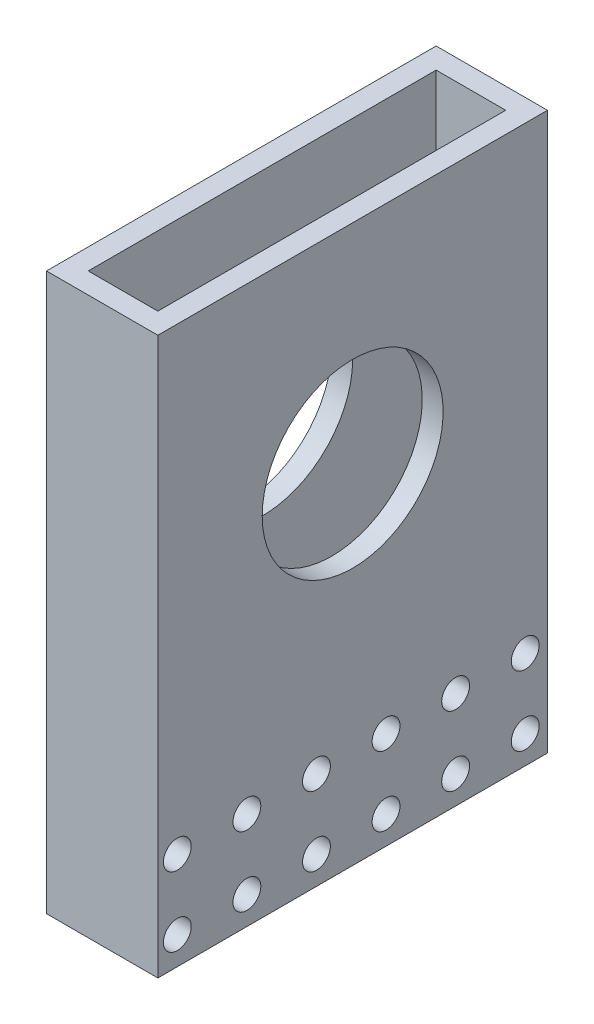
ISO-10303-21;
HEADER;
FILE_DESCRIPTION(('STEP AP214'),'2;1');
FILE_NAME('part.step','',(''),(''),'','','');
FILE_SCHEMA(('AUTOMOTIVE_DESIGN { 1 0 10303 214 1 1 1 1 }'));
ENDSEC;
DATA;
#1=APPLICATION_CONTEXT('core data for automotive mechanical design processes');
#2=APPLICATION_PROTOCOL_DEFINITION('international standard','automotive_design',2000,#1);
#3=PRODUCT_CONTEXT('',#1,'mechanical');
#4=PRODUCT('Part','Part','',(#3));
#5=PRODUCT_RELATED_PRODUCT_CATEGORY('part','',(#4));
#6=PRODUCT_DEFINITION_FORMATION('','',#4);
#7=PRODUCT_DEFINITION_CONTEXT('part definition',#1,'design');
#8=PRODUCT_DEFINITION('design','',#6,#7);
#9=PRODUCT_DEFINITION_SHAPE('','',#8);
#10=(LENGTH_UNIT() NAMED_UNIT(*) SI_UNIT(.MILLI.,.METRE.));
#11=(NAMED_UNIT(*) PLANE_ANGLE_UNIT() SI_UNIT($,.RADIAN.));
#12=(NAMED_UNIT(*) SI_UNIT($,.STERADIAN.) SOLID_ANGLE_UNIT());
#13=UNCERTAINTY_MEASURE_WITH_UNIT(LENGTH_MEASURE(1.E-05),#10,'distance_accuracy_value','');
#14=(GEOMETRIC_REPRESENTATION_CONTEXT(3) GLOBAL_UNCERTAINTY_ASSIGNED_CONTEXT((#13)) GLOBAL_UNIT_ASSIGNED_CONTEXT((#10,
#11,#12)) REPRESENTATION_CONTEXT('',''));
#15=CARTESIAN_POINT('',(0.,0.,0.));
#16=DIRECTION('',(0.,0.,1.));
#17=DIRECTION('',(1.,0.,0.));
#18=AXIS2_PLACEMENT_3D('',#15,#16,#17);
#19=CARTESIAN_POINT('',(-5.,80.,-25.));
#20=DIRECTION('',(0.,0.,1.));
#21=DIRECTION('',(1.,0.,0.));
#22=AXIS2_PLACEMENT_3D('',#19,#20,#21);
#23=PLANE('',#22);
#24=DIRECTION('',(-1.,0.,0.));
#25=VECTOR('',#24,1.);
#26=CARTESIAN_POINT('',(8.,16.005241127961,-25.));
#27=LINE('',#26,#25);
#28=CARTESIAN_POINT('',(5.,16.005241127961,-25.));
#29=VERTEX_POINT('',#28);
#30=CARTESIAN_POINT('',(-5.,16.005241127961,-25.));
#31=VERTEX_POINT('',#30);
#32=EDGE_CURVE('E94',#29,#31,#27,.T.);
#33=ORIENTED_EDGE('',*,*,#32,.F.);
#34=DIRECTION('',(0.,-1.,0.));
#35=VECTOR('',#34,1.);
#36=CARTESIAN_POINT('',(5.,80.,-25.));
#37=LINE('',#36,#35);
#38=CARTESIAN_POINT('',(5.,80.,-25.));
#39=VERTEX_POINT('',#38);
#40=EDGE_CURVE('E238',#39,#29,#37,.T.);
#41=ORIENTED_EDGE('',*,*,#40,.F.);
#42=DIRECTION('',(-1.,0.,0.));
#43=VECTOR('',#42,1.);
#44=CARTESIAN_POINT('',(-5.,80.,-25.));
#45=LINE('',#44,#43);
#46=CARTESIAN_POINT('',(-5.,80.,-25.));
#47=VERTEX_POINT('',#46);
#48=EDGE_CURVE('E354',#39,#47,#45,.T.);
#49=ORIENTED_EDGE('',*,*,#48,.T.);
#50=DIRECTION('',(0.,-1.,0.));
#51=VECTOR('',#50,1.);
#52=CARTESIAN_POINT('',(-5.,80.,-25.));
#53=LINE('',#52,#51);
#54=EDGE_CURVE('E232',#47,#31,#53,.T.);
#55=ORIENTED_EDGE('',*,*,#54,.T.);
#56=EDGE_LOOP('',(#33,#41,#49,#55));
#57=FACE_BOUND('',#56,.T.);
#58=ADVANCED_FACE('F69',(#57),#23,.T.);
#59=DIRECTION('',(-1.,0.,0.));
#60=VECTOR('',#59,1.);
#61=CARTESIAN_POINT('',(8.,12.0258257956885,-25.));
#62=LINE('',#61,#60);
#63=CARTESIAN_POINT('',(-5.,12.0258257956885,-25.));
#64=VERTEX_POINT('',#63);
#65=CARTESIAN_POINT('',(5.,12.0258257956885,-25.));
#66=VERTEX_POINT('',#65);
#67=EDGE_CURVE('E431',#64,#66,#62,.F.);
#68=ORIENTED_EDGE('',*,*,#67,.F.);
#69=CARTESIAN_POINT('',(-5.,6.00524112796099,-25.));
#70=VERTEX_POINT('',#69);
#71=EDGE_CURVE('E237',#64,#70,#53,.T.);
#72=ORIENTED_EDGE('',*,*,#71,.T.);
#73=DIRECTION('',(-1.,0.,0.));
#74=VECTOR('',#73,1.);
#75=CARTESIAN_POINT('',(8.,6.00524112796099,-25.));
#76=LINE('',#75,#74);
#77=CARTESIAN_POINT('',(5.,6.00524112796099,-25.));
#78=VERTEX_POINT('',#77);
#79=EDGE_CURVE('E87',#78,#70,#76,.T.);
#80=ORIENTED_EDGE('',*,*,#79,.F.);
#81=EDGE_CURVE('E243',#66,#78,#37,.T.);
#82=ORIENTED_EDGE('',*,*,#81,.F.);
#83=EDGE_LOOP('',(#68,#72,#80,#82));
#84=FACE_BOUND('',#83,.T.);
#85=ADVANCED_FACE('F453',(#84),#23,.T.);
#86=CARTESIAN_POINT('',(-5.,80.,25.));
#87=DIRECTION('',(0.,0.,-1.));
#88=DIRECTION('',(-1.,0.,0.));
#89=AXIS2_PLACEMENT_3D('',#86,#87,#88);
#90=PLANE('',#89);
#91=DIRECTION('',(-1.,0.,0.));
#92=VECTOR('',#91,1.);
#93=CARTESIAN_POINT('',(8.00000000000001,12.0258257956885,25.));
#94=LINE('',#93,#92);
#95=CARTESIAN_POINT('',(5.,12.0258257956885,25.));
#96=VERTEX_POINT('',#95);
#97=CARTESIAN_POINT('',(-5.,12.0258257956885,25.));
#98=VERTEX_POINT('',#97);
#99=EDGE_CURVE('E213',#96,#98,#94,.T.);
#100=ORIENTED_EDGE('',*,*,#99,.F.);
#101=DIRECTION('',(0.,-1.,0.));
#102=VECTOR('',#101,1.);
#103=CARTESIAN_POINT('',(5.,80.,25.));
#104=LINE('',#103,#102);
#105=CARTESIAN_POINT('',(5.,6.00524112796099,25.));
#106=VERTEX_POINT('',#105);
#107=EDGE_CURVE('E205',#96,#106,#104,.T.);
#108=ORIENTED_EDGE('',*,*,#107,.T.);
#109=DIRECTION('',(-1.,0.,0.));
#110=VECTOR('',#109,1.);
#111=CARTESIAN_POINT('',(8.00000000000001,6.00524112796099,25.));
#112=LINE('',#111,#110);
#113=CARTESIAN_POINT('',(-5.,6.005241127961,25.));
#114=VERTEX_POINT('',#113);
#115=EDGE_CURVE('E183',#114,#106,#112,.F.);
#116=ORIENTED_EDGE('',*,*,#115,.F.);
#117=DIRECTION('',(0.,-1.,0.));
#118=VECTOR('',#117,1.);
#119=CARTESIAN_POINT('',(-5.,80.,25.));
#120=LINE('',#119,#118);
#121=EDGE_CURVE('E231',#98,#114,#120,.T.);
#122=ORIENTED_EDGE('',*,*,#121,.F.);
#123=EDGE_LOOP('',(#100,#108,#116,#122));
#124=FACE_BOUND('',#123,.T.);
#125=ADVANCED_FACE('F212',(#124),#90,.T.);
#126=DIRECTION('',(-1.,0.,0.));
#127=VECTOR('',#126,1.);
#128=CARTESIAN_POINT('',(8.00000000000001,2.02582579568853,25.));
#129=LINE('',#128,#127);
#130=CARTESIAN_POINT('',(5.,2.02582579568853,25.));
#131=VERTEX_POINT('',#130);
#132=CARTESIAN_POINT('',(-5.,2.02582579568853,25.));
#133=VERTEX_POINT('',#132);
#134=EDGE_CURVE('E196',#131,#133,#129,.T.);
#135=ORIENTED_EDGE('',*,*,#134,.F.);
#136=CARTESIAN_POINT('',(5.,0.,25.));
#137=VERTEX_POINT('',#136);
#138=EDGE_CURVE('E207',#131,#137,#104,.T.);
#139=ORIENTED_EDGE('',*,*,#138,.T.);
#140=DIRECTION('',(1.,0.,0.));
#141=VECTOR('',#140,1.);
#142=CARTESIAN_POINT('',(-5.,0.,25.));
#143=LINE('',#142,#141);
#144=CARTESIAN_POINT('',(-5.,0.,25.));
#145=VERTEX_POINT('',#144);
#146=EDGE_CURVE('E224',#145,#137,#143,.T.);
#147=ORIENTED_EDGE('',*,*,#146,.F.);
#148=EDGE_CURVE('E220',#133,#145,#120,.T.);
#149=ORIENTED_EDGE('',*,*,#148,.F.);
#150=EDGE_LOOP('',(#135,#139,#147,#149));
#151=FACE_BOUND('',#150,.T.);
#152=ADVANCED_FACE('F380',(#151),#90,.T.);
#153=CARTESIAN_POINT('',(0.,80.,0.));
#154=DIRECTION('',(0.,1.,0.));
#155=DIRECTION('',(0.,0.,1.));
#156=AXIS2_PLACEMENT_3D('',#153,#154,#155);
#157=PLANE('',#156);
#158=DIRECTION('',(0.,0.,-1.));
#159=VECTOR('',#158,1.);
#160=CARTESIAN_POINT('',(8.,80.,-25.));
#161=LINE('',#160,#159);
#162=CARTESIAN_POINT('',(8.,80.,28.));
#163=VERTEX_POINT('',#162);
#164=CARTESIAN_POINT('',(8.,80.,-28.));
#165=VERTEX_POINT('',#164);
#166=EDGE_CURVE('E244',#163,#165,#161,.T.);
#167=ORIENTED_EDGE('',*,*,#166,.T.);
#168=DIRECTION('',(-1.,0.,0.));
#169=VECTOR('',#168,1.);
#170=CARTESIAN_POINT('',(-5.,80.,-28.));
#171=LINE('',#170,#169);
#172=CARTESIAN_POINT('',(-8.,80.,-28.));
#173=VERTEX_POINT('',#172);
#174=EDGE_CURVE('E248',#165,#173,#171,.T.);
#175=ORIENTED_EDGE('',*,*,#174,.T.);
#176=DIRECTION('',(0.,0.,1.));
#177=VECTOR('',#176,1.);
#178=CARTESIAN_POINT('',(-8.,80.,-25.));
#179=LINE('',#178,#177);
#180=CARTESIAN_POINT('',(-8.,80.,28.));
#181=VERTEX_POINT('',#180);
#182=EDGE_CURVE('E252',#173,#181,#179,.T.);
#183=ORIENTED_EDGE('',*,*,#182,.T.);
#184=DIRECTION('',(1.,0.,0.));
#185=VECTOR('',#184,1.);
#186=CARTESIAN_POINT('',(-5.,80.,28.));
#187=LINE('',#186,#185);
#188=EDGE_CURVE('E255',#181,#163,#187,.T.);
#189=ORIENTED_EDGE('',*,*,#188,.T.);
#190=EDGE_LOOP('',(#167,#175,#183,#189));
#191=FACE_BOUND('',#190,.T.);
#192=ORIENTED_EDGE('',*,*,#48,.F.);
#193=DIRECTION('',(0.,0.,-1.));
#194=VECTOR('',#193,1.);
#195=CARTESIAN_POINT('',(5.,80.,-25.));
#196=LINE('',#195,#194);
#197=CARTESIAN_POINT('',(5.,80.,25.));
#198=VERTEX_POINT('',#197);
#199=EDGE_CURVE('E351',#198,#39,#196,.T.);
#200=ORIENTED_EDGE('',*,*,#199,.F.);
#201=DIRECTION('',(1.,0.,0.));
#202=VECTOR('',#201,1.);
#203=CARTESIAN_POINT('',(-5.,80.,25.));
#204=LINE('',#203,#202);
#205=CARTESIAN_POINT('',(-5.,80.,25.));
#206=VERTEX_POINT('',#205);
#207=EDGE_CURVE('E221',#206,#198,#204,.T.);
#208=ORIENTED_EDGE('',*,*,#207,.F.);
#209=DIRECTION('',(0.,0.,1.));
#210=VECTOR('',#209,1.);
#211=CARTESIAN_POINT('',(-5.,80.,-25.));
#212=LINE('',#211,#210);
#213=EDGE_CURVE('E357',#47,#206,#212,.T.);
#214=ORIENTED_EDGE('',*,*,#213,.F.);
#215=EDGE_LOOP('',(#192,#200,#208,#214));
#216=FACE_BOUND('',#215,.T.);
#217=ADVANCED_FACE('F448',(#191,#216),#157,.T.);
#218=CARTESIAN_POINT('',(0.,0.,0.));
#219=DIRECTION('',(0.,1.,0.));
#220=DIRECTION('',(0.,0.,1.));
#221=AXIS2_PLACEMENT_3D('',#218,#219,#220);
#222=PLANE('',#221);
#223=DIRECTION('',(0.,0.,-1.));
#224=VECTOR('',#223,1.);
#225=CARTESIAN_POINT('',(8.,0.,-25.));
#226=LINE('',#225,#224);
#227=CARTESIAN_POINT('',(8.,0.,28.));
#228=VERTEX_POINT('',#227);
#229=CARTESIAN_POINT('',(8.,0.,-28.));
#230=VERTEX_POINT('',#229);
#231=EDGE_CURVE('E242',#228,#230,#226,.T.);
#232=ORIENTED_EDGE('',*,*,#231,.F.);
#233=DIRECTION('',(1.,0.,0.));
#234=VECTOR('',#233,1.);
#235=CARTESIAN_POINT('',(-5.,0.,28.));
#236=LINE('',#235,#234);
#237=CARTESIAN_POINT('',(-8.,0.,28.));
#238=VERTEX_POINT('',#237);
#239=EDGE_CURVE('E249',#238,#228,#236,.T.);
#240=ORIENTED_EDGE('',*,*,#239,.F.);
#241=DIRECTION('',(0.,0.,1.));
#242=VECTOR('',#241,1.);
#243=CARTESIAN_POINT('',(-8.,0.,-25.));
#244=LINE('',#243,#242);
#245=CARTESIAN_POINT('',(-8.,0.,-28.));
#246=VERTEX_POINT('',#245);
#247=EDGE_CURVE('E265',#246,#238,#244,.T.);
#248=ORIENTED_EDGE('',*,*,#247,.F.);
#249=DIRECTION('',(-1.,0.,0.));
#250=VECTOR('',#249,1.);
#251=CARTESIAN_POINT('',(-5.,0.,-28.));
#252=LINE('',#251,#250);
#253=EDGE_CURVE('E262',#230,#246,#252,.T.);
#254=ORIENTED_EDGE('',*,*,#253,.F.);
#255=EDGE_LOOP('',(#232,#240,#248,#254));
#256=FACE_BOUND('',#255,.T.);
#257=DIRECTION('',(0.,0.,-1.));
#258=VECTOR('',#257,1.);
#259=CARTESIAN_POINT('',(5.,0.,-25.));
#260=LINE('',#259,#258);
#261=CARTESIAN_POINT('',(5.,0.,-25.));
#262=VERTEX_POINT('',#261);
#263=EDGE_CURVE('E350',#137,#262,#260,.T.);
#264=ORIENTED_EDGE('',*,*,#263,.T.);
#265=DIRECTION('',(-1.,0.,0.));
#266=VECTOR('',#265,1.);
#267=CARTESIAN_POINT('',(-5.,0.,-25.));
#268=LINE('',#267,#266);
#269=CARTESIAN_POINT('',(-5.,0.,-25.));
#270=VERTEX_POINT('',#269);
#271=EDGE_CURVE('E366',#262,#270,#268,.T.);
#272=ORIENTED_EDGE('',*,*,#271,.T.);
#273=DIRECTION('',(0.,0.,1.));
#274=VECTOR('',#273,1.);
#275=CARTESIAN_POINT('',(-5.,0.,-25.));
#276=LINE('',#275,#274);
#277=EDGE_CURVE('E369',#270,#145,#276,.T.);
#278=ORIENTED_EDGE('',*,*,#277,.T.);
#279=ORIENTED_EDGE('',*,*,#146,.T.);
#280=EDGE_LOOP('',(#264,#272,#278,#279));
#281=FACE_BOUND('',#280,.T.);
#282=ADVANCED_FACE('F377',(#256,#281),#222,.F.);
#283=CARTESIAN_POINT('',(8.,80.,-25.));
#284=DIRECTION('',(-1.,0.,0.));
#285=DIRECTION('',(0.,0.,1.));
#286=AXIS2_PLACEMENT_3D('',#283,#284,#285);
#287=PLANE('',#286);
#288=CARTESIAN_POINT('',(8.00000000000001,50.,0.));
#289=DIRECTION('',(-1.,0.,0.));
#290=DIRECTION('',(0.,0.,1.));
#291=AXIS2_PLACEMENT_3D('',#288,#289,#290);
#292=CIRCLE('',#291,13.);
#293=CARTESIAN_POINT('',(8.00000000000001,50.,13.));
#294=VERTEX_POINT('',#293);
#295=EDGE_CURVE('E515',#294,#294,#292,.T.);
#296=ORIENTED_EDGE('',*,*,#295,.T.);
#297=EDGE_LOOP('',(#296));
#298=FACE_BOUND('',#297,.T.);
#299=CARTESIAN_POINT('',(8.00000000000001,14.0155334618248,5.2026410701677));
#300=DIRECTION('',(-1.,0.,0.));
#301=DIRECTION('',(0.,0.,1.));
#302=AXIS2_PLACEMENT_3D('',#299,#300,#301);
#303=CIRCLE('',#302,2.);
#304=CARTESIAN_POINT('',(8.00000000000001,14.0155334618248,7.20264107016771));
#305=VERTEX_POINT('',#304);
#306=EDGE_CURVE('E519',#305,#305,#303,.T.);
#307=ORIENTED_EDGE('',*,*,#306,.T.);
#308=EDGE_LOOP('',(#307));
#309=FACE_BOUND('',#308,.T.);
#310=CARTESIAN_POINT('',(8.00000000000001,14.0155334618248,15.2026410701677));
#311=DIRECTION('',(-1.,0.,0.));
#312=DIRECTION('',(0.,0.,1.));
#313=AXIS2_PLACEMENT_3D('',#310,#311,#312);
#314=CIRCLE('',#313,2.);
#315=CARTESIAN_POINT('',(8.00000000000001,14.0155334618248,17.2026410701677));
#316=VERTEX_POINT('',#315);
#317=EDGE_CURVE('E523',#316,#316,#314,.T.);
#318=ORIENTED_EDGE('',*,*,#317,.T.);
#319=EDGE_LOOP('',(#318));
#320=FACE_BOUND('',#319,.T.);
#321=CARTESIAN_POINT('',(8.00000000000001,14.0155334618248,25.2026410701677));
#322=DIRECTION('',(-1.,0.,0.));
#323=DIRECTION('',(0.,0.,1.));
#324=AXIS2_PLACEMENT_3D('',#321,#322,#323);
#325=CIRCLE('',#324,2.);
#326=CARTESIAN_POINT('',(8.00000000000001,14.0155334618248,27.2026410701677));
#327=VERTEX_POINT('',#326);
#328=EDGE_CURVE('E527',#327,#327,#325,.T.);
#329=ORIENTED_EDGE('',*,*,#328,.T.);
#330=EDGE_LOOP('',(#329));
#331=FACE_BOUND('',#330,.T.);
#332=CARTESIAN_POINT('',(8.,14.0155334618248,-24.7973589298323));
#333=DIRECTION('',(-1.,0.,0.));
#334=DIRECTION('',(0.,0.,1.));
#335=AXIS2_PLACEMENT_3D('',#332,#333,#334);
#336=CIRCLE('',#335,2.);
#337=CARTESIAN_POINT('',(8.,14.0155334618248,-22.7973589298323));
#338=VERTEX_POINT('',#337);
#339=EDGE_CURVE('E531',#338,#338,#336,.T.);
#340=ORIENTED_EDGE('',*,*,#339,.T.);
#341=EDGE_LOOP('',(#340));
#342=FACE_BOUND('',#341,.T.);
#343=CARTESIAN_POINT('',(8.,4.01553346182476,-24.7973589298323));
#344=DIRECTION('',(-1.,0.,0.));
#345=DIRECTION('',(0.,0.,1.));
#346=AXIS2_PLACEMENT_3D('',#343,#344,#345);
#347=CIRCLE('',#346,2.);
#348=CARTESIAN_POINT('',(8.,4.01553346182476,-22.7973589298323));
#349=VERTEX_POINT('',#348);
#350=EDGE_CURVE('E535',#349,#349,#347,.T.);
#351=ORIENTED_EDGE('',*,*,#350,.T.);
#352=EDGE_LOOP('',(#351));
#353=FACE_BOUND('',#352,.T.);
#354=CARTESIAN_POINT('',(8.00000000000001,4.01553346182476,-14.7973589298323));
#355=DIRECTION('',(-1.,0.,0.));
#356=DIRECTION('',(0.,0.,1.));
#357=AXIS2_PLACEMENT_3D('',#354,#355,#356);
#358=CIRCLE('',#357,2.);
#359=CARTESIAN_POINT('',(8.00000000000001,4.01553346182476,-12.7973589298323));
#360=VERTEX_POINT('',#359);
#361=EDGE_CURVE('E539',#360,#360,#358,.T.);
#362=ORIENTED_EDGE('',*,*,#361,.T.);
#363=EDGE_LOOP('',(#362));
#364=FACE_BOUND('',#363,.T.);
#365=CARTESIAN_POINT('',(8.00000000000001,4.01553346182476,-4.79735892983226));
#366=DIRECTION('',(-1.,0.,0.));
#367=DIRECTION('',(0.,0.,1.));
#368=AXIS2_PLACEMENT_3D('',#365,#366,#367);
#369=CIRCLE('',#368,2.);
#370=CARTESIAN_POINT('',(8.00000000000001,4.01553346182476,-2.79735892983226));
#371=VERTEX_POINT('',#370);
#372=EDGE_CURVE('E543',#371,#371,#369,.T.);
#373=ORIENTED_EDGE('',*,*,#372,.T.);
#374=EDGE_LOOP('',(#373));
#375=FACE_BOUND('',#374,.T.);
#376=CARTESIAN_POINT('',(8.00000000000001,4.01553346182476,5.20264107016774));
#377=DIRECTION('',(-1.,0.,0.));
#378=DIRECTION('',(0.,0.,1.));
#379=AXIS2_PLACEMENT_3D('',#376,#377,#378);
#380=CIRCLE('',#379,2.);
#381=CARTESIAN_POINT('',(8.00000000000001,4.01553346182476,7.20264107016774));
#382=VERTEX_POINT('',#381);
#383=EDGE_CURVE('E547',#382,#382,#380,.T.);
#384=ORIENTED_EDGE('',*,*,#383,.T.);
#385=EDGE_LOOP('',(#384));
#386=FACE_BOUND('',#385,.T.);
#387=CARTESIAN_POINT('',(8.00000000000001,4.01553346182476,15.2026410701677));
#388=DIRECTION('',(-1.,0.,0.));
#389=DIRECTION('',(0.,0.,1.));
#390=AXIS2_PLACEMENT_3D('',#387,#388,#389);
#391=CIRCLE('',#390,2.);
#392=CARTESIAN_POINT('',(8.00000000000001,4.01553346182476,17.2026410701677));
#393=VERTEX_POINT('',#392);
#394=EDGE_CURVE('E551',#393,#393,#391,.T.);
#395=ORIENTED_EDGE('',*,*,#394,.T.);
#396=EDGE_LOOP('',(#395));
#397=FACE_BOUND('',#396,.T.);
#398=CARTESIAN_POINT('',(8.00000000000001,4.01553346182476,25.2026410701677));
#399=DIRECTION('',(-1.,0.,0.));
#400=DIRECTION('',(0.,0.,1.));
#401=AXIS2_PLACEMENT_3D('',#398,#399,#400);
#402=CIRCLE('',#401,2.);
#403=CARTESIAN_POINT('',(8.00000000000001,4.01553346182476,27.2026410701677));
#404=VERTEX_POINT('',#403);
#405=EDGE_CURVE('E555',#404,#404,#402,.T.);
#406=ORIENTED_EDGE('',*,*,#405,.T.);
#407=EDGE_LOOP('',(#406));
#408=FACE_BOUND('',#407,.T.);
#409=CARTESIAN_POINT('',(8.00000000000001,14.0155334618248,-14.7973589298323));
#410=DIRECTION('',(-1.,0.,0.));
#411=DIRECTION('',(0.,0.,1.));
#412=AXIS2_PLACEMENT_3D('',#409,#410,#411);
#413=CIRCLE('',#412,2.);
#414=CARTESIAN_POINT('',(8.00000000000001,14.0155334618248,-12.7973589298323));
#415=VERTEX_POINT('',#414);
#416=EDGE_CURVE('E559',#415,#415,#413,.T.);
#417=ORIENTED_EDGE('',*,*,#416,.T.);
#418=EDGE_LOOP('',(#417));
#419=FACE_BOUND('',#418,.T.);
#420=CARTESIAN_POINT('',(8.00000000000001,14.0155334618248,-4.79735892983229));
#421=DIRECTION('',(-1.,0.,0.));
#422=DIRECTION('',(0.,0.,1.));
#423=AXIS2_PLACEMENT_3D('',#420,#421,#422);
#424=CIRCLE('',#423,2.);
#425=CARTESIAN_POINT('',(8.00000000000001,14.0155334618248,-2.7973589298323));
#426=VERTEX_POINT('',#425);
#427=EDGE_CURVE('E562',#426,#426,#424,.T.);
#428=ORIENTED_EDGE('',*,*,#427,.T.);
#429=EDGE_LOOP('',(#428));
#430=FACE_BOUND('',#429,.T.);
#431=ORIENTED_EDGE('',*,*,#231,.T.);
#432=DIRECTION('',(0.,-1.,0.));
#433=VECTOR('',#432,1.);
#434=CARTESIAN_POINT('',(8.,80.,-28.));
#435=LINE('',#434,#433);
#436=EDGE_CURVE('E197',#165,#230,#435,.T.);
#437=ORIENTED_EDGE('',*,*,#436,.F.);
#438=ORIENTED_EDGE('',*,*,#166,.F.);
#439=DIRECTION('',(0.,-1.,0.));
#440=VECTOR('',#439,1.);
#441=CARTESIAN_POINT('',(8.,80.,28.));
#442=LINE('',#441,#440);
#443=EDGE_CURVE('E258',#163,#228,#442,.T.);
#444=ORIENTED_EDGE('',*,*,#443,.T.);
#445=EDGE_LOOP('',(#431,#437,#438,#444));
#446=FACE_BOUND('',#445,.T.);
#447=ADVANCED_FACE('F71',(#298,#309,#320,#331,#342,#353,#364,#375,#386,#397,#408,#419,#430,
#446),#287,.F.);
#448=CARTESIAN_POINT('',(-5.,80.,-28.));
#449=DIRECTION('',(0.,0.,1.));
#450=DIRECTION('',(1.,0.,0.));
#451=AXIS2_PLACEMENT_3D('',#448,#449,#450);
#452=PLANE('',#451);
#453=ORIENTED_EDGE('',*,*,#253,.T.);
#454=DIRECTION('',(0.,-1.,0.));
#455=VECTOR('',#454,1.);
#456=CARTESIAN_POINT('',(-8.,80.,-28.));
#457=LINE('',#456,#455);
#458=EDGE_CURVE('E277',#173,#246,#457,.T.);
#459=ORIENTED_EDGE('',*,*,#458,.F.);
#460=ORIENTED_EDGE('',*,*,#174,.F.);
#461=ORIENTED_EDGE('',*,*,#436,.T.);
#462=EDGE_LOOP('',(#453,#459,#460,#461));
#463=FACE_BOUND('',#462,.T.);
#464=ADVANCED_FACE('F490',(#463),#452,.F.);
#465=CARTESIAN_POINT('',(-8.,80.,-25.));
#466=DIRECTION('',(1.,0.,0.));
#467=DIRECTION('',(0.,0.,-1.));
#468=AXIS2_PLACEMENT_3D('',#465,#466,#467);
#469=PLANE('',#468);
#470=CARTESIAN_POINT('',(-8.,50.,0.));
#471=DIRECTION('',(-1.,0.,0.));
#472=DIRECTION('',(0.,0.,1.));
#473=AXIS2_PLACEMENT_3D('',#470,#471,#472);
#474=CIRCLE('',#473,13.);
#475=CARTESIAN_POINT('',(-8.,50.,13.));
#476=VERTEX_POINT('',#475);
#477=EDGE_CURVE('E578',#476,#476,#474,.T.);
#478=ORIENTED_EDGE('',*,*,#477,.F.);
#479=EDGE_LOOP('',(#478));
#480=FACE_BOUND('',#479,.T.);
#481=CARTESIAN_POINT('',(-8.,14.0155334618248,5.20264107016771));
#482=DIRECTION('',(-1.,0.,0.));
#483=DIRECTION('',(0.,0.,1.));
#484=AXIS2_PLACEMENT_3D('',#481,#482,#483);
#485=CIRCLE('',#484,2.);
#486=CARTESIAN_POINT('',(-8.,14.0155334618248,7.20264107016771));
#487=VERTEX_POINT('',#486);
#488=EDGE_CURVE('E622',#487,#487,#485,.T.);
#489=ORIENTED_EDGE('',*,*,#488,.F.);
#490=EDGE_LOOP('',(#489));
#491=FACE_BOUND('',#490,.T.);
#492=CARTESIAN_POINT('',(-8.,14.0155334618248,15.2026410701677));
#493=DIRECTION('',(-1.,0.,0.));
#494=DIRECTION('',(0.,0.,1.));
#495=AXIS2_PLACEMENT_3D('',#492,#493,#494);
#496=CIRCLE('',#495,2.);
#497=CARTESIAN_POINT('',(-8.,14.0155334618248,17.2026410701677));
#498=VERTEX_POINT('',#497);
#499=EDGE_CURVE('E609',#498,#498,#496,.T.);
#500=ORIENTED_EDGE('',*,*,#499,.F.);
#501=EDGE_LOOP('',(#500));
#502=FACE_BOUND('',#501,.T.);
#503=CARTESIAN_POINT('',(-8.,14.0155334618248,25.2026410701677));
#504=DIRECTION('',(-1.,0.,0.));
#505=DIRECTION('',(0.,0.,1.));
#506=AXIS2_PLACEMENT_3D('',#503,#504,#505);
#507=CIRCLE('',#506,2.);
#508=CARTESIAN_POINT('',(-8.,14.0155334618248,27.2026410701677));
#509=VERTEX_POINT('',#508);
#510=EDGE_CURVE('E610',#509,#509,#507,.T.);
#511=ORIENTED_EDGE('',*,*,#510,.F.);
#512=EDGE_LOOP('',(#511));
#513=FACE_BOUND('',#512,.T.);
#514=CARTESIAN_POINT('',(-8.,14.0155334618248,-24.7973589298323));
#515=DIRECTION('',(-1.,0.,0.));
#516=DIRECTION('',(0.,0.,1.));
#517=AXIS2_PLACEMENT_3D('',#514,#515,#516);
#518=CIRCLE('',#517,2.);
#519=CARTESIAN_POINT('',(-8.,14.0155334618248,-22.7973589298323));
#520=VERTEX_POINT('',#519);
#521=EDGE_CURVE('E616',#520,#520,#518,.T.);
#522=ORIENTED_EDGE('',*,*,#521,.F.);
#523=EDGE_LOOP('',(#522));
#524=FACE_BOUND('',#523,.T.);
#525=CARTESIAN_POINT('',(-8.,4.01553346182476,-24.7973589298323));
#526=DIRECTION('',(-1.,0.,0.));
#527=DIRECTION('',(0.,0.,1.));
#528=AXIS2_PLACEMENT_3D('',#525,#526,#527);
#529=CIRCLE('',#528,2.);
#530=CARTESIAN_POINT('',(-8.,4.01553346182476,-22.7973589298323));
#531=VERTEX_POINT('',#530);
#532=EDGE_CURVE('E579',#531,#531,#529,.T.);
#533=ORIENTED_EDGE('',*,*,#532,.F.);
#534=EDGE_LOOP('',(#533));
#535=FACE_BOUND('',#534,.T.);
#536=CARTESIAN_POINT('',(-8.,4.01553346182476,-14.7973589298323));
#537=DIRECTION('',(-1.,0.,0.));
#538=DIRECTION('',(0.,0.,1.));
#539=AXIS2_PLACEMENT_3D('',#536,#537,#538);
#540=CIRCLE('',#539,2.);
#541=CARTESIAN_POINT('',(-8.,4.01553346182476,-12.7973589298323));
#542=VERTEX_POINT('',#541);
#543=EDGE_CURVE('E585',#542,#542,#540,.T.);
#544=ORIENTED_EDGE('',*,*,#543,.F.);
#545=EDGE_LOOP('',(#544));
#546=FACE_BOUND('',#545,.T.);
#547=CARTESIAN_POINT('',(-8.,4.01553346182476,-4.79735892983226));
#548=DIRECTION('',(-1.,0.,0.));
#549=DIRECTION('',(0.,0.,1.));
#550=AXIS2_PLACEMENT_3D('',#547,#548,#549);
#551=CIRCLE('',#550,2.);
#552=CARTESIAN_POINT('',(-8.,4.01553346182476,-2.79735892983226));
#553=VERTEX_POINT('',#552);
#554=EDGE_CURVE('E591',#553,#553,#551,.T.);
#555=ORIENTED_EDGE('',*,*,#554,.F.);
#556=EDGE_LOOP('',(#555));
#557=FACE_BOUND('',#556,.T.);
#558=CARTESIAN_POINT('',(-8.,4.01553346182476,5.20264107016774));
#559=DIRECTION('',(-1.,0.,0.));
#560=DIRECTION('',(0.,0.,1.));
#561=AXIS2_PLACEMENT_3D('',#558,#559,#560);
#562=CIRCLE('',#561,2.);
#563=CARTESIAN_POINT('',(-8.,4.01553346182476,7.20264107016774));
#564=VERTEX_POINT('',#563);
#565=EDGE_CURVE('E597',#564,#564,#562,.T.);
#566=ORIENTED_EDGE('',*,*,#565,.F.);
#567=EDGE_LOOP('',(#566));
#568=FACE_BOUND('',#567,.T.);
#569=CARTESIAN_POINT('',(-8.,4.01553346182476,15.2026410701677));
#570=DIRECTION('',(-1.,0.,0.));
#571=DIRECTION('',(0.,0.,1.));
#572=AXIS2_PLACEMENT_3D('',#569,#570,#571);
#573=CIRCLE('',#572,2.);
#574=CARTESIAN_POINT('',(-8.,4.01553346182476,17.2026410701677));
#575=VERTEX_POINT('',#574);
#576=EDGE_CURVE('E633',#575,#575,#573,.T.);
#577=ORIENTED_EDGE('',*,*,#576,.F.);
#578=EDGE_LOOP('',(#577));
#579=FACE_BOUND('',#578,.T.);
#580=CARTESIAN_POINT('',(-8.,4.01553346182476,25.2026410701677));
#581=DIRECTION('',(-1.,0.,0.));
#582=DIRECTION('',(0.,0.,1.));
#583=AXIS2_PLACEMENT_3D('',#580,#581,#582);
#584=CIRCLE('',#583,2.);
#585=CARTESIAN_POINT('',(-8.,4.01553346182476,27.2026410701677));
#586=VERTEX_POINT('',#585);
#587=EDGE_CURVE('E639',#586,#586,#584,.T.);
#588=ORIENTED_EDGE('',*,*,#587,.F.);
#589=EDGE_LOOP('',(#588));
#590=FACE_BOUND('',#589,.T.);
#591=CARTESIAN_POINT('',(-8.,14.0155334618248,-14.7973589298323));
#592=DIRECTION('',(-1.,0.,0.));
#593=DIRECTION('',(0.,0.,1.));
#594=AXIS2_PLACEMENT_3D('',#591,#592,#593);
#595=CIRCLE('',#594,2.);
#596=CARTESIAN_POINT('',(-8.,14.0155334618248,-12.7973589298323));
#597=VERTEX_POINT('',#596);
#598=EDGE_CURVE('E565',#597,#597,#595,.T.);
#599=ORIENTED_EDGE('',*,*,#598,.F.);
#600=EDGE_LOOP('',(#599));
#601=FACE_BOUND('',#600,.T.);
#602=CARTESIAN_POINT('',(-8.,14.0155334618248,-4.79735892983229));
#603=DIRECTION('',(-1.,0.,0.));
#604=DIRECTION('',(0.,0.,1.));
#605=AXIS2_PLACEMENT_3D('',#602,#603,#604);
#606=CIRCLE('',#605,2.);
#607=CARTESIAN_POINT('',(-8.,14.0155334618248,-2.79735892983229));
#608=VERTEX_POINT('',#607);
#609=EDGE_CURVE('E566',#608,#608,#606,.T.);
#610=ORIENTED_EDGE('',*,*,#609,.F.);
#611=EDGE_LOOP('',(#610));
#612=FACE_BOUND('',#611,.T.);
#613=ORIENTED_EDGE('',*,*,#247,.T.);
#614=DIRECTION('',(0.,-1.,0.));
#615=VECTOR('',#614,1.);
#616=CARTESIAN_POINT('',(-8.,80.,28.));
#617=LINE('',#616,#615);
#618=EDGE_CURVE('E273',#181,#238,#617,.T.);
#619=ORIENTED_EDGE('',*,*,#618,.F.);
#620=ORIENTED_EDGE('',*,*,#182,.F.);
#621=ORIENTED_EDGE('',*,*,#458,.T.);
#622=EDGE_LOOP('',(#613,#619,#620,#621));
#623=FACE_BOUND('',#622,.T.);
#624=ADVANCED_FACE('F477',(#480,#491,#502,#513,#524,#535,#546,#557,#568,#579,#590,#601,#612,
#623),#469,.F.);
#625=CARTESIAN_POINT('',(-5.,80.,28.));
#626=DIRECTION('',(0.,0.,-1.));
#627=DIRECTION('',(-1.,0.,0.));
#628=AXIS2_PLACEMENT_3D('',#625,#626,#627);
#629=PLANE('',#628);
#630=ORIENTED_EDGE('',*,*,#239,.T.);
#631=ORIENTED_EDGE('',*,*,#443,.F.);
#632=ORIENTED_EDGE('',*,*,#188,.F.);
#633=ORIENTED_EDGE('',*,*,#618,.T.);
#634=EDGE_LOOP('',(#630,#631,#632,#633));
#635=FACE_BOUND('',#634,.T.);
#636=ADVANCED_FACE('F472',(#635),#629,.F.);
#637=CARTESIAN_POINT('',(5.,80.,-25.));
#638=DIRECTION('',(-1.,0.,0.));
#639=DIRECTION('',(0.,0.,1.));
#640=AXIS2_PLACEMENT_3D('',#637,#638,#639);
#641=PLANE('',#640);
#642=CARTESIAN_POINT('',(5.,50.,0.));
#643=DIRECTION('',(-1.,0.,0.));
#644=DIRECTION('',(0.,0.,1.));
#645=AXIS2_PLACEMENT_3D('',#642,#643,#644);
#646=CIRCLE('',#645,13.);
#647=CARTESIAN_POINT('',(5.,50.,13.));
#648=VERTEX_POINT('',#647);
#649=EDGE_CURVE('E346',#648,#648,#646,.T.);
#650=ORIENTED_EDGE('',*,*,#649,.F.);
#651=EDGE_LOOP('',(#650));
#652=FACE_BOUND('',#651,.T.);
#653=CARTESIAN_POINT('',(5.,14.0155334618248,5.2026410701677));
#654=DIRECTION('',(-1.,0.,0.));
#655=DIRECTION('',(0.,0.,1.));
#656=AXIS2_PLACEMENT_3D('',#653,#654,#655);
#657=CIRCLE('',#656,2.);
#658=CARTESIAN_POINT('',(5.,14.0155334618248,7.20264107016771));
#659=VERTEX_POINT('',#658);
#660=EDGE_CURVE('E332',#659,#659,#657,.T.);
#661=ORIENTED_EDGE('',*,*,#660,.F.);
#662=EDGE_LOOP('',(#661));
#663=FACE_BOUND('',#662,.T.);
#664=CARTESIAN_POINT('',(5.,14.0155334618248,15.2026410701677));
#665=DIRECTION('',(-1.,0.,0.));
#666=DIRECTION('',(0.,0.,1.));
#667=AXIS2_PLACEMENT_3D('',#664,#665,#666);
#668=CIRCLE('',#667,2.);
#669=CARTESIAN_POINT('',(5.,14.0155334618248,17.2026410701677));
#670=VERTEX_POINT('',#669);
#671=EDGE_CURVE('E327',#670,#670,#668,.T.);
#672=ORIENTED_EDGE('',*,*,#671,.F.);
#673=EDGE_LOOP('',(#672));
#674=FACE_BOUND('',#673,.T.);
#675=CARTESIAN_POINT('',(5.,14.0155334618248,25.2026410701677));
#676=DIRECTION('',(-1.,0.,0.));
#677=DIRECTION('',(0.,0.,1.));
#678=AXIS2_PLACEMENT_3D('',#675,#676,#677);
#679=CIRCLE('',#678,2.);
#680=CARTESIAN_POINT('',(5.,16.005241127961,25.));
#681=VERTEX_POINT('',#680);
#682=EDGE_CURVE('E296',#681,#96,#679,.T.);
#683=ORIENTED_EDGE('',*,*,#682,.F.);
#684=EDGE_CURVE('E215',#198,#681,#104,.T.);
#685=ORIENTED_EDGE('',*,*,#684,.F.);
#686=ORIENTED_EDGE('',*,*,#199,.T.);
#687=ORIENTED_EDGE('',*,*,#40,.T.);
#688=CARTESIAN_POINT('',(5.,14.0155334618248,-24.7973589298323));
#689=DIRECTION('',(-1.,0.,0.));
#690=DIRECTION('',(0.,0.,1.));
#691=AXIS2_PLACEMENT_3D('',#688,#689,#690);
#692=CIRCLE('',#691,2.);
#693=EDGE_CURVE('E328',#66,#29,#692,.T.);
#694=ORIENTED_EDGE('',*,*,#693,.F.);
#695=ORIENTED_EDGE('',*,*,#81,.T.);
#696=CARTESIAN_POINT('',(5.,4.01553346182476,-24.7973589298323));
#697=DIRECTION('',(-1.,0.,0.));
#698=DIRECTION('',(0.,0.,1.));
#699=AXIS2_PLACEMENT_3D('',#696,#697,#698);
#700=CIRCLE('',#699,2.);
#701=CARTESIAN_POINT('',(5.,2.02582579568853,-25.));
#702=VERTEX_POINT('',#701);
#703=EDGE_CURVE('E385',#702,#78,#700,.T.);
#704=ORIENTED_EDGE('',*,*,#703,.F.);
#705=EDGE_CURVE('E236',#702,#262,#37,.T.);
#706=ORIENTED_EDGE('',*,*,#705,.T.);
#707=ORIENTED_EDGE('',*,*,#263,.F.);
#708=ORIENTED_EDGE('',*,*,#138,.F.);
#709=CARTESIAN_POINT('',(5.,4.01553346182476,25.2026410701677));
#710=DIRECTION('',(-1.,0.,0.));
#711=DIRECTION('',(0.,0.,1.));
#712=AXIS2_PLACEMENT_3D('',#709,#710,#711);
#713=CIRCLE('',#712,2.);
#714=EDGE_CURVE('E187',#106,#131,#713,.T.);
#715=ORIENTED_EDGE('',*,*,#714,.F.);
#716=ORIENTED_EDGE('',*,*,#107,.F.);
#717=EDGE_LOOP('',(#683,#685,#686,#687,#694,#695,#704,#706,#707,#708,#715,#716));
#718=FACE_BOUND('',#717,.T.);
#719=CARTESIAN_POINT('',(5.,4.01553346182476,-14.7973589298323));
#720=DIRECTION('',(-1.,0.,0.));
#721=DIRECTION('',(0.,0.,1.));
#722=AXIS2_PLACEMENT_3D('',#719,#720,#721);
#723=CIRCLE('',#722,2.);
#724=CARTESIAN_POINT('',(5.,4.01553346182476,-12.7973589298323));
#725=VERTEX_POINT('',#724);
#726=EDGE_CURVE('E321',#725,#725,#723,.T.);
#727=ORIENTED_EDGE('',*,*,#726,.F.);
#728=EDGE_LOOP('',(#727));
#729=FACE_BOUND('',#728,.T.);
#730=CARTESIAN_POINT('',(5.,4.01553346182476,-4.79735892983226));
#731=DIRECTION('',(-1.,0.,0.));
#732=DIRECTION('',(0.,0.,1.));
#733=AXIS2_PLACEMENT_3D('',#730,#731,#732);
#734=CIRCLE('',#733,2.);
#735=CARTESIAN_POINT('',(5.,4.01553346182476,-2.79735892983226));
#736=VERTEX_POINT('',#735);
#737=EDGE_CURVE('E316',#736,#736,#734,.T.);
#738=ORIENTED_EDGE('',*,*,#737,.F.);
#739=EDGE_LOOP('',(#738));
#740=FACE_BOUND('',#739,.T.);
#741=CARTESIAN_POINT('',(5.,4.01553346182476,5.20264107016774));
#742=DIRECTION('',(-1.,0.,0.));
#743=DIRECTION('',(0.,0.,1.));
#744=AXIS2_PLACEMENT_3D('',#741,#742,#743);
#745=CIRCLE('',#744,2.);
#746=CARTESIAN_POINT('',(5.,4.01553346182476,7.20264107016774));
#747=VERTEX_POINT('',#746);
#748=EDGE_CURVE('E311',#747,#747,#745,.T.);
#749=ORIENTED_EDGE('',*,*,#748,.F.);
#750=EDGE_LOOP('',(#749));
#751=FACE_BOUND('',#750,.T.);
#752=CARTESIAN_POINT('',(5.,4.01553346182476,15.2026410701677));
#753=DIRECTION('',(-1.,0.,0.));
#754=DIRECTION('',(0.,0.,1.));
#755=AXIS2_PLACEMENT_3D('',#752,#753,#754);
#756=CIRCLE('',#755,2.);
#757=CARTESIAN_POINT('',(5.,4.01553346182476,17.2026410701677));
#758=VERTEX_POINT('',#757);
#759=EDGE_CURVE('E306',#758,#758,#756,.T.);
#760=ORIENTED_EDGE('',*,*,#759,.F.);
#761=EDGE_LOOP('',(#760));
#762=FACE_BOUND('',#761,.T.);
#763=CARTESIAN_POINT('',(5.,14.0155334618248,-14.7973589298323));
#764=DIRECTION('',(-1.,0.,0.));
#765=DIRECTION('',(0.,0.,1.));
#766=AXIS2_PLACEMENT_3D('',#763,#764,#765);
#767=CIRCLE('',#766,2.);
#768=CARTESIAN_POINT('',(5.,14.0155334618248,-12.7973589298323));
#769=VERTEX_POINT('',#768);
#770=EDGE_CURVE('E301',#769,#769,#767,.T.);
#771=ORIENTED_EDGE('',*,*,#770,.F.);
#772=EDGE_LOOP('',(#771));
#773=FACE_BOUND('',#772,.T.);
#774=CARTESIAN_POINT('',(5.,14.0155334618248,-4.79735892983229));
#775=DIRECTION('',(-1.,0.,0.));
#776=DIRECTION('',(0.,0.,1.));
#777=AXIS2_PLACEMENT_3D('',#774,#775,#776);
#778=CIRCLE('',#777,2.);
#779=CARTESIAN_POINT('',(5.,14.0155334618248,-2.7973589298323));
#780=VERTEX_POINT('',#779);
#781=EDGE_CURVE('E295',#780,#780,#778,.T.);
#782=ORIENTED_EDGE('',*,*,#781,.F.);
#783=EDGE_LOOP('',(#782));
#784=FACE_BOUND('',#783,.T.);
#785=ADVANCED_FACE('F203',(#652,#663,#674,#718,#729,#740,#751,#762,#773,#784),#641,.T.);
#786=DIRECTION('',(-1.,0.,0.));
#787=VECTOR('',#786,1.);
#788=CARTESIAN_POINT('',(8.,2.02582579568853,-25.));
#789=LINE('',#788,#787);
#790=CARTESIAN_POINT('',(-5.,2.02582579568853,-25.));
#791=VERTEX_POINT('',#790);
#792=EDGE_CURVE('E391',#791,#702,#789,.F.);
#793=ORIENTED_EDGE('',*,*,#792,.F.);
#794=EDGE_CURVE('E230',#791,#270,#53,.T.);
#795=ORIENTED_EDGE('',*,*,#794,.T.);
#796=ORIENTED_EDGE('',*,*,#271,.F.);
#797=ORIENTED_EDGE('',*,*,#705,.F.);
#798=EDGE_LOOP('',(#793,#795,#796,#797));
#799=FACE_BOUND('',#798,.T.);
#800=ADVANCED_FACE('F389',(#799),#23,.T.);
#801=CARTESIAN_POINT('',(-5.,80.,-25.));
#802=DIRECTION('',(1.,0.,0.));
#803=DIRECTION('',(0.,0.,-1.));
#804=AXIS2_PLACEMENT_3D('',#801,#802,#803);
#805=PLANE('',#804);
#806=CARTESIAN_POINT('',(-5.,50.,0.));
#807=DIRECTION('',(1.,0.,0.));
#808=DIRECTION('',(0.,0.,-1.));
#809=AXIS2_PLACEMENT_3D('',#806,#807,#808);
#810=CIRCLE('',#809,13.);
#811=CARTESIAN_POINT('',(-5.,50.,-13.));
#812=VERTEX_POINT('',#811);
#813=EDGE_CURVE('E73',#812,#812,#810,.T.);
#814=ORIENTED_EDGE('',*,*,#813,.F.);
#815=EDGE_LOOP('',(#814));
#816=FACE_BOUND('',#815,.T.);
#817=CARTESIAN_POINT('',(-5.,14.0155334618248,5.20264107016771));
#818=DIRECTION('',(1.,0.,0.));
#819=DIRECTION('',(0.,0.,-1.));
#820=AXIS2_PLACEMENT_3D('',#817,#818,#819);
#821=CIRCLE('',#820,2.);
#822=CARTESIAN_POINT('',(-5.,14.0155334618248,3.2026410701677));
#823=VERTEX_POINT('',#822);
#824=EDGE_CURVE('E329',#823,#823,#821,.T.);
#825=ORIENTED_EDGE('',*,*,#824,.F.);
#826=EDGE_LOOP('',(#825));
#827=FACE_BOUND('',#826,.T.);
#828=CARTESIAN_POINT('',(-5.,14.0155334618248,15.2026410701677));
#829=DIRECTION('',(1.,0.,0.));
#830=DIRECTION('',(0.,0.,-1.));
#831=AXIS2_PLACEMENT_3D('',#828,#829,#830);
#832=CIRCLE('',#831,2.);
#833=CARTESIAN_POINT('',(-5.,14.0155334618248,13.2026410701677));
#834=VERTEX_POINT('',#833);
#835=EDGE_CURVE('E324',#834,#834,#832,.T.);
#836=ORIENTED_EDGE('',*,*,#835,.F.);
#837=EDGE_LOOP('',(#836));
#838=FACE_BOUND('',#837,.T.);
#839=CARTESIAN_POINT('',(-5.,14.0155334618248,25.2026410701677));
#840=DIRECTION('',(1.,0.,0.));
#841=DIRECTION('',(0.,0.,-1.));
#842=AXIS2_PLACEMENT_3D('',#839,#840,#841);
#843=CIRCLE('',#842,2.);
#844=CARTESIAN_POINT('',(-5.,16.005241127961,25.));
#845=VERTEX_POINT('',#844);
#846=EDGE_CURVE('E209',#98,#845,#843,.T.);
#847=ORIENTED_EDGE('',*,*,#846,.F.);
#848=ORIENTED_EDGE('',*,*,#121,.T.);
#849=CARTESIAN_POINT('',(-5.,4.01553346182476,25.2026410701677));
#850=DIRECTION('',(1.,0.,0.));
#851=DIRECTION('',(0.,0.,-1.));
#852=AXIS2_PLACEMENT_3D('',#849,#850,#851);
#853=CIRCLE('',#852,2.);
#854=EDGE_CURVE('E190',#133,#114,#853,.T.);
#855=ORIENTED_EDGE('',*,*,#854,.F.);
#856=ORIENTED_EDGE('',*,*,#148,.T.);
#857=ORIENTED_EDGE('',*,*,#277,.F.);
#858=ORIENTED_EDGE('',*,*,#794,.F.);
#859=CARTESIAN_POINT('',(-5.,4.01553346182476,-24.7973589298323));
#860=DIRECTION('',(1.,0.,0.));
#861=DIRECTION('',(0.,0.,-1.));
#862=AXIS2_PLACEMENT_3D('',#859,#860,#861);
#863=CIRCLE('',#862,2.);
#864=EDGE_CURVE('E79',#70,#791,#863,.T.);
#865=ORIENTED_EDGE('',*,*,#864,.F.);
#866=ORIENTED_EDGE('',*,*,#71,.F.);
#867=CARTESIAN_POINT('',(-5.,14.0155334618248,-24.7973589298323));
#868=DIRECTION('',(1.,0.,0.));
#869=DIRECTION('',(0.,0.,-1.));
#870=AXIS2_PLACEMENT_3D('',#867,#868,#869);
#871=CIRCLE('',#870,2.);
#872=EDGE_CURVE('E12',#31,#64,#871,.T.);
#873=ORIENTED_EDGE('',*,*,#872,.F.);
#874=ORIENTED_EDGE('',*,*,#54,.F.);
#875=ORIENTED_EDGE('',*,*,#213,.T.);
#876=EDGE_CURVE('E226',#206,#845,#120,.T.);
#877=ORIENTED_EDGE('',*,*,#876,.T.);
#878=EDGE_LOOP('',(#847,#848,#855,#856,#857,#858,#865,#866,#873,#874,#875,#877));
#879=FACE_BOUND('',#878,.T.);
#880=CARTESIAN_POINT('',(-5.,4.01553346182476,-14.7973589298323));
#881=DIRECTION('',(1.,0.,0.));
#882=DIRECTION('',(0.,0.,-1.));
#883=AXIS2_PLACEMENT_3D('',#880,#881,#882);
#884=CIRCLE('',#883,2.);
#885=CARTESIAN_POINT('',(-5.,4.01553346182476,-16.7973589298323));
#886=VERTEX_POINT('',#885);
#887=EDGE_CURVE('E317',#886,#886,#884,.T.);
#888=ORIENTED_EDGE('',*,*,#887,.F.);
#889=EDGE_LOOP('',(#888));
#890=FACE_BOUND('',#889,.T.);
#891=CARTESIAN_POINT('',(-5.,4.01553346182476,-4.79735892983226));
#892=DIRECTION('',(1.,0.,0.));
#893=DIRECTION('',(0.,0.,-1.));
#894=AXIS2_PLACEMENT_3D('',#891,#892,#893);
#895=CIRCLE('',#894,2.);
#896=CARTESIAN_POINT('',(-5.,4.01553346182476,-6.79735892983226));
#897=VERTEX_POINT('',#896);
#898=EDGE_CURVE('E312',#897,#897,#895,.T.);
#899=ORIENTED_EDGE('',*,*,#898,.F.);
#900=EDGE_LOOP('',(#899));
#901=FACE_BOUND('',#900,.T.);
#902=CARTESIAN_POINT('',(-5.,4.01553346182476,5.20264107016774));
#903=DIRECTION('',(1.,0.,0.));
#904=DIRECTION('',(0.,0.,-1.));
#905=AXIS2_PLACEMENT_3D('',#902,#903,#904);
#906=CIRCLE('',#905,2.);
#907=CARTESIAN_POINT('',(-5.,4.01553346182476,3.20264107016774));
#908=VERTEX_POINT('',#907);
#909=EDGE_CURVE('E307',#908,#908,#906,.T.);
#910=ORIENTED_EDGE('',*,*,#909,.F.);
#911=EDGE_LOOP('',(#910));
#912=FACE_BOUND('',#911,.T.);
#913=CARTESIAN_POINT('',(-5.,4.01553346182476,15.2026410701677));
#914=DIRECTION('',(1.,0.,0.));
#915=DIRECTION('',(0.,0.,-1.));
#916=AXIS2_PLACEMENT_3D('',#913,#914,#915);
#917=CIRCLE('',#916,2.);
#918=CARTESIAN_POINT('',(-5.,4.01553346182476,13.2026410701677));
#919=VERTEX_POINT('',#918);
#920=EDGE_CURVE('E302',#919,#919,#917,.T.);
#921=ORIENTED_EDGE('',*,*,#920,.F.);
#922=EDGE_LOOP('',(#921));
#923=FACE_BOUND('',#922,.T.);
#924=CARTESIAN_POINT('',(-5.,14.0155334618248,-14.7973589298323));
#925=DIRECTION('',(1.,0.,0.));
#926=DIRECTION('',(0.,0.,-1.));
#927=AXIS2_PLACEMENT_3D('',#924,#925,#926);
#928=CIRCLE('',#927,2.);
#929=CARTESIAN_POINT('',(-5.,14.0155334618248,-16.7973589298323));
#930=VERTEX_POINT('',#929);
#931=EDGE_CURVE('E297',#930,#930,#928,.T.);
#932=ORIENTED_EDGE('',*,*,#931,.F.);
#933=EDGE_LOOP('',(#932));
#934=FACE_BOUND('',#933,.T.);
#935=CARTESIAN_POINT('',(-5.,14.0155334618248,-4.79735892983229));
#936=DIRECTION('',(1.,0.,0.));
#937=DIRECTION('',(0.,0.,-1.));
#938=AXIS2_PLACEMENT_3D('',#935,#936,#937);
#939=CIRCLE('',#938,2.);
#940=CARTESIAN_POINT('',(-5.,14.0155334618248,-6.79735892983229));
#941=VERTEX_POINT('',#940);
#942=EDGE_CURVE('E291',#941,#941,#939,.T.);
#943=ORIENTED_EDGE('',*,*,#942,.F.);
#944=EDGE_LOOP('',(#943));
#945=FACE_BOUND('',#944,.T.);
#946=ADVANCED_FACE('F395',(#816,#827,#838,#879,#890,#901,#912,#923,#934,#945),#805,.T.);
#947=DIRECTION('',(-1.,0.,0.));
#948=VECTOR('',#947,1.);
#949=CARTESIAN_POINT('',(8.00000000000001,16.005241127961,25.));
#950=LINE('',#949,#948);
#951=EDGE_CURVE('E286',#845,#681,#950,.F.);
#952=ORIENTED_EDGE('',*,*,#951,.F.);
#953=ORIENTED_EDGE('',*,*,#876,.F.);
#954=ORIENTED_EDGE('',*,*,#207,.T.);
#955=ORIENTED_EDGE('',*,*,#684,.T.);
#956=EDGE_LOOP('',(#952,#953,#954,#955));
#957=FACE_BOUND('',#956,.T.);
#958=ADVANCED_FACE('F463',(#957),#90,.T.);
#959=CARTESIAN_POINT('',(8.00000000000001,4.01553346182476,25.2026410701677));
#960=DIRECTION('',(-1.,0.,0.));
#961=DIRECTION('',(0.,0.,1.));
#962=AXIS2_PLACEMENT_3D('',#959,#960,#961);
#963=CYLINDRICAL_SURFACE('',#962,2.);
#964=ORIENTED_EDGE('',*,*,#134,.T.);
#965=ORIENTED_EDGE('',*,*,#854,.T.);
#966=ORIENTED_EDGE('',*,*,#115,.T.);
#967=ORIENTED_EDGE('',*,*,#714,.T.);
#968=EDGE_LOOP('',(#964,#965,#966,#967));
#969=FACE_BOUND('',#968,.T.);
#970=ORIENTED_EDGE('',*,*,#405,.F.);
#971=EDGE_LOOP('',(#970));
#972=FACE_BOUND('',#971,.T.);
#973=ORIENTED_EDGE('',*,*,#587,.T.);
#974=EDGE_LOOP('',(#973));
#975=FACE_BOUND('',#974,.T.);
#976=ADVANCED_FACE('F185',(#969,#972,#975),#963,.F.);
#977=CARTESIAN_POINT('',(8.00000000000001,14.0155334618248,25.2026410701677));
#978=DIRECTION('',(-1.,0.,0.));
#979=DIRECTION('',(0.,0.,1.));
#980=AXIS2_PLACEMENT_3D('',#977,#978,#979);
#981=CYLINDRICAL_SURFACE('',#980,2.);
#982=ORIENTED_EDGE('',*,*,#99,.T.);
#983=ORIENTED_EDGE('',*,*,#846,.T.);
#984=ORIENTED_EDGE('',*,*,#951,.T.);
#985=ORIENTED_EDGE('',*,*,#682,.T.);
#986=EDGE_LOOP('',(#982,#983,#984,#985));
#987=FACE_BOUND('',#986,.T.);
#988=ORIENTED_EDGE('',*,*,#328,.F.);
#989=EDGE_LOOP('',(#988));
#990=FACE_BOUND('',#989,.T.);
#991=ORIENTED_EDGE('',*,*,#510,.T.);
#992=EDGE_LOOP('',(#991));
#993=FACE_BOUND('',#992,.T.);
#994=ADVANCED_FACE('F654',(#987,#990,#993),#981,.F.);
#995=CARTESIAN_POINT('',(8.00000000000001,14.0155334618248,-4.79735892983229));
#996=DIRECTION('',(-1.,0.,0.));
#997=DIRECTION('',(0.,0.,1.));
#998=AXIS2_PLACEMENT_3D('',#995,#996,#997);
#999=CYLINDRICAL_SURFACE('',#998,2.);
#1000=ORIENTED_EDGE('',*,*,#942,.T.);
#1001=EDGE_LOOP('',(#1000));
#1002=FACE_BOUND('',#1001,.T.);
#1003=ORIENTED_EDGE('',*,*,#609,.T.);
#1004=EDGE_LOOP('',(#1003));
#1005=FACE_BOUND('',#1004,.T.);
#1006=ADVANCED_FACE('F651',(#1002,#1005),#999,.F.);
#1007=CARTESIAN_POINT('',(8.00000000000001,14.0155334618248,-14.7973589298323));
#1008=DIRECTION('',(-1.,0.,0.));
#1009=DIRECTION('',(0.,0.,1.));
#1010=AXIS2_PLACEMENT_3D('',#1007,#1008,#1009);
#1011=CYLINDRICAL_SURFACE('',#1010,2.);
#1012=ORIENTED_EDGE('',*,*,#931,.T.);
#1013=EDGE_LOOP('',(#1012));
#1014=FACE_BOUND('',#1013,.T.);
#1015=ORIENTED_EDGE('',*,*,#598,.T.);
#1016=EDGE_LOOP('',(#1015));
#1017=FACE_BOUND('',#1016,.T.);
#1018=ADVANCED_FACE('F653',(#1014,#1017),#1011,.F.);
#1019=CARTESIAN_POINT('',(8.00000000000001,4.01553346182476,15.2026410701677));
#1020=DIRECTION('',(-1.,0.,0.));
#1021=DIRECTION('',(0.,0.,1.));
#1022=AXIS2_PLACEMENT_3D('',#1019,#1020,#1021);
#1023=CYLINDRICAL_SURFACE('',#1022,2.);
#1024=ORIENTED_EDGE('',*,*,#920,.T.);
#1025=EDGE_LOOP('',(#1024));
#1026=FACE_BOUND('',#1025,.T.);
#1027=ORIENTED_EDGE('',*,*,#576,.T.);
#1028=EDGE_LOOP('',(#1027));
#1029=FACE_BOUND('',#1028,.T.);
#1030=ADVANCED_FACE('F662',(#1026,#1029),#1023,.F.);
#1031=CARTESIAN_POINT('',(8.00000000000001,4.01553346182476,5.20264107016774));
#1032=DIRECTION('',(-1.,0.,0.));
#1033=DIRECTION('',(0.,0.,1.));
#1034=AXIS2_PLACEMENT_3D('',#1031,#1032,#1033);
#1035=CYLINDRICAL_SURFACE('',#1034,2.);
#1036=ORIENTED_EDGE('',*,*,#909,.T.);
#1037=EDGE_LOOP('',(#1036));
#1038=FACE_BOUND('',#1037,.T.);
#1039=ORIENTED_EDGE('',*,*,#565,.T.);
#1040=EDGE_LOOP('',(#1039));
#1041=FACE_BOUND('',#1040,.T.);
#1042=ADVANCED_FACE('F711',(#1038,#1041),#1035,.F.);
#1043=CARTESIAN_POINT('',(8.00000000000001,4.01553346182476,-4.79735892983226));
#1044=DIRECTION('',(-1.,0.,0.));
#1045=DIRECTION('',(0.,0.,1.));
#1046=AXIS2_PLACEMENT_3D('',#1043,#1044,#1045);
#1047=CYLINDRICAL_SURFACE('',#1046,2.);
#1048=ORIENTED_EDGE('',*,*,#898,.T.);
#1049=EDGE_LOOP('',(#1048));
#1050=FACE_BOUND('',#1049,.T.);
#1051=ORIENTED_EDGE('',*,*,#554,.T.);
#1052=EDGE_LOOP('',(#1051));
#1053=FACE_BOUND('',#1052,.T.);
#1054=ADVANCED_FACE('F825',(#1050,#1053),#1047,.F.);
#1055=CARTESIAN_POINT('',(8.00000000000001,4.01553346182476,-14.7973589298323));
#1056=DIRECTION('',(-1.,0.,0.));
#1057=DIRECTION('',(0.,0.,1.));
#1058=AXIS2_PLACEMENT_3D('',#1055,#1056,#1057);
#1059=CYLINDRICAL_SURFACE('',#1058,2.);
#1060=ORIENTED_EDGE('',*,*,#887,.T.);
#1061=EDGE_LOOP('',(#1060));
#1062=FACE_BOUND('',#1061,.T.);
#1063=ORIENTED_EDGE('',*,*,#543,.T.);
#1064=EDGE_LOOP('',(#1063));
#1065=FACE_BOUND('',#1064,.T.);
#1066=ADVANCED_FACE('F835',(#1062,#1065),#1059,.F.);
#1067=CARTESIAN_POINT('',(8.,4.01553346182476,-24.7973589298323));
#1068=DIRECTION('',(-1.,0.,0.));
#1069=DIRECTION('',(0.,0.,1.));
#1070=AXIS2_PLACEMENT_3D('',#1067,#1068,#1069);
#1071=CYLINDRICAL_SURFACE('',#1070,2.);
#1072=ORIENTED_EDGE('',*,*,#703,.T.);
#1073=ORIENTED_EDGE('',*,*,#79,.T.);
#1074=ORIENTED_EDGE('',*,*,#864,.T.);
#1075=ORIENTED_EDGE('',*,*,#792,.T.);
#1076=EDGE_LOOP('',(#1072,#1073,#1074,#1075));
#1077=FACE_BOUND('',#1076,.T.);
#1078=ORIENTED_EDGE('',*,*,#350,.F.);
#1079=EDGE_LOOP('',(#1078));
#1080=FACE_BOUND('',#1079,.T.);
#1081=ORIENTED_EDGE('',*,*,#532,.T.);
#1082=EDGE_LOOP('',(#1081));
#1083=FACE_BOUND('',#1082,.T.);
#1084=ADVANCED_FACE('F846',(#1077,#1080,#1083),#1071,.F.);
#1085=CARTESIAN_POINT('',(8.,14.0155334618248,-24.7973589298323));
#1086=DIRECTION('',(-1.,0.,0.));
#1087=DIRECTION('',(0.,0.,1.));
#1088=AXIS2_PLACEMENT_3D('',#1085,#1086,#1087);
#1089=CYLINDRICAL_SURFACE('',#1088,2.);
#1090=ORIENTED_EDGE('',*,*,#693,.T.);
#1091=ORIENTED_EDGE('',*,*,#32,.T.);
#1092=ORIENTED_EDGE('',*,*,#872,.T.);
#1093=ORIENTED_EDGE('',*,*,#67,.T.);
#1094=EDGE_LOOP('',(#1090,#1091,#1092,#1093));
#1095=FACE_BOUND('',#1094,.T.);
#1096=ORIENTED_EDGE('',*,*,#339,.F.);
#1097=EDGE_LOOP('',(#1096));
#1098=FACE_BOUND('',#1097,.T.);
#1099=ORIENTED_EDGE('',*,*,#521,.T.);
#1100=EDGE_LOOP('',(#1099));
#1101=FACE_BOUND('',#1100,.T.);
#1102=ADVANCED_FACE('F436',(#1095,#1098,#1101),#1089,.F.);
#1103=CARTESIAN_POINT('',(8.00000000000001,14.0155334618248,15.2026410701677));
#1104=DIRECTION('',(-1.,0.,0.));
#1105=DIRECTION('',(0.,0.,1.));
#1106=AXIS2_PLACEMENT_3D('',#1103,#1104,#1105);
#1107=CYLINDRICAL_SURFACE('',#1106,2.);
#1108=ORIENTED_EDGE('',*,*,#835,.T.);
#1109=EDGE_LOOP('',(#1108));
#1110=FACE_BOUND('',#1109,.T.);
#1111=ORIENTED_EDGE('',*,*,#499,.T.);
#1112=EDGE_LOOP('',(#1111));
#1113=FACE_BOUND('',#1112,.T.);
#1114=ADVANCED_FACE('F686',(#1110,#1113),#1107,.F.);
#1115=CARTESIAN_POINT('',(8.00000000000001,14.0155334618248,5.2026410701677));
#1116=DIRECTION('',(-1.,0.,0.));
#1117=DIRECTION('',(0.,0.,1.));
#1118=AXIS2_PLACEMENT_3D('',#1115,#1116,#1117);
#1119=CYLINDRICAL_SURFACE('',#1118,2.);
#1120=ORIENTED_EDGE('',*,*,#824,.T.);
#1121=EDGE_LOOP('',(#1120));
#1122=FACE_BOUND('',#1121,.T.);
#1123=ORIENTED_EDGE('',*,*,#488,.T.);
#1124=EDGE_LOOP('',(#1123));
#1125=FACE_BOUND('',#1124,.T.);
#1126=ADVANCED_FACE('F677',(#1122,#1125),#1119,.F.);
#1127=CARTESIAN_POINT('',(8.00000000000001,50.,0.));
#1128=DIRECTION('',(-1.,0.,0.));
#1129=DIRECTION('',(0.,0.,1.));
#1130=AXIS2_PLACEMENT_3D('',#1127,#1128,#1129);
#1131=CYLINDRICAL_SURFACE('',#1130,13.);
#1132=ORIENTED_EDGE('',*,*,#813,.T.);
#1133=EDGE_LOOP('',(#1132));
#1134=FACE_BOUND('',#1133,.T.);
#1135=ORIENTED_EDGE('',*,*,#477,.T.);
#1136=EDGE_LOOP('',(#1135));
#1137=FACE_BOUND('',#1136,.T.);
#1138=ADVANCED_FACE('F669',(#1134,#1137),#1131,.F.);
#1139=ORIENTED_EDGE('',*,*,#781,.T.);
#1140=EDGE_LOOP('',(#1139));
#1141=FACE_BOUND('',#1140,.T.);
#1142=ORIENTED_EDGE('',*,*,#427,.F.);
#1143=EDGE_LOOP('',(#1142));
#1144=FACE_BOUND('',#1143,.T.);
#1145=ADVANCED_FACE('F657',(#1141,#1144),#999,.F.);
#1146=ORIENTED_EDGE('',*,*,#770,.T.);
#1147=EDGE_LOOP('',(#1146));
#1148=FACE_BOUND('',#1147,.T.);
#1149=ORIENTED_EDGE('',*,*,#416,.F.);
#1150=EDGE_LOOP('',(#1149));
#1151=FACE_BOUND('',#1150,.T.);
#1152=ADVANCED_FACE('F665',(#1148,#1151),#1011,.F.);
#1153=ORIENTED_EDGE('',*,*,#759,.T.);
#1154=EDGE_LOOP('',(#1153));
#1155=FACE_BOUND('',#1154,.T.);
#1156=ORIENTED_EDGE('',*,*,#394,.F.);
#1157=EDGE_LOOP('',(#1156));
#1158=FACE_BOUND('',#1157,.T.);
#1159=ADVANCED_FACE('F675',(#1155,#1158),#1023,.F.);
#1160=ORIENTED_EDGE('',*,*,#748,.T.);
#1161=EDGE_LOOP('',(#1160));
#1162=FACE_BOUND('',#1161,.T.);
#1163=ORIENTED_EDGE('',*,*,#383,.F.);
#1164=EDGE_LOOP('',(#1163));
#1165=FACE_BOUND('',#1164,.T.);
#1166=ADVANCED_FACE('F827',(#1162,#1165),#1035,.F.);
#1167=ORIENTED_EDGE('',*,*,#737,.T.);
#1168=EDGE_LOOP('',(#1167));
#1169=FACE_BOUND('',#1168,.T.);
#1170=ORIENTED_EDGE('',*,*,#372,.F.);
#1171=EDGE_LOOP('',(#1170));
#1172=FACE_BOUND('',#1171,.T.);
#1173=ADVANCED_FACE('F838',(#1169,#1172),#1047,.F.);
#1174=ORIENTED_EDGE('',*,*,#726,.T.);
#1175=EDGE_LOOP('',(#1174));
#1176=FACE_BOUND('',#1175,.T.);
#1177=ORIENTED_EDGE('',*,*,#361,.F.);
#1178=EDGE_LOOP('',(#1177));
#1179=FACE_BOUND('',#1178,.T.);
#1180=ADVANCED_FACE('F702',(#1176,#1179),#1059,.F.);
#1181=ORIENTED_EDGE('',*,*,#671,.T.);
#1182=EDGE_LOOP('',(#1181));
#1183=FACE_BOUND('',#1182,.T.);
#1184=ORIENTED_EDGE('',*,*,#317,.F.);
#1185=EDGE_LOOP('',(#1184));
#1186=FACE_BOUND('',#1185,.T.);
#1187=ADVANCED_FACE('F696',(#1183,#1186),#1107,.F.);
#1188=ORIENTED_EDGE('',*,*,#660,.T.);
#1189=EDGE_LOOP('',(#1188));
#1190=FACE_BOUND('',#1189,.T.);
#1191=ORIENTED_EDGE('',*,*,#306,.F.);
#1192=EDGE_LOOP('',(#1191));
#1193=FACE_BOUND('',#1192,.T.);
#1194=ADVANCED_FACE('F688',(#1190,#1193),#1119,.F.);
#1195=ORIENTED_EDGE('',*,*,#649,.T.);
#1196=EDGE_LOOP('',(#1195));
#1197=FACE_BOUND('',#1196,.T.);
#1198=ORIENTED_EDGE('',*,*,#295,.F.);
#1199=EDGE_LOOP('',(#1198));
#1200=FACE_BOUND('',#1199,.T.);
#1201=ADVANCED_FACE('F680',(#1197,#1200),#1131,.F.);
#1202=CLOSED_SHELL('',(#58,#85,#125,#152,#217,#282,#447,#464,#624,#636,#785,#800,#946,#958,#976,
#994,#1006,#1018,#1030,#1042,#1054,#1066,#1084,#1102,#1114,#1126,#1138,#1145,#1152,#1159,#1166,
#1173,#1180,#1187,#1194,#1201));
#1203=MANIFOLD_SOLID_BREP('B2',#1202);
#1204=ADVANCED_BREP_SHAPE_REPRESENTATION('',(#18,#1203),#14);
#1205=SHAPE_DEFINITION_REPRESENTATION(#9,#1204);
ENDSEC;
END-ISO-10303-21;
